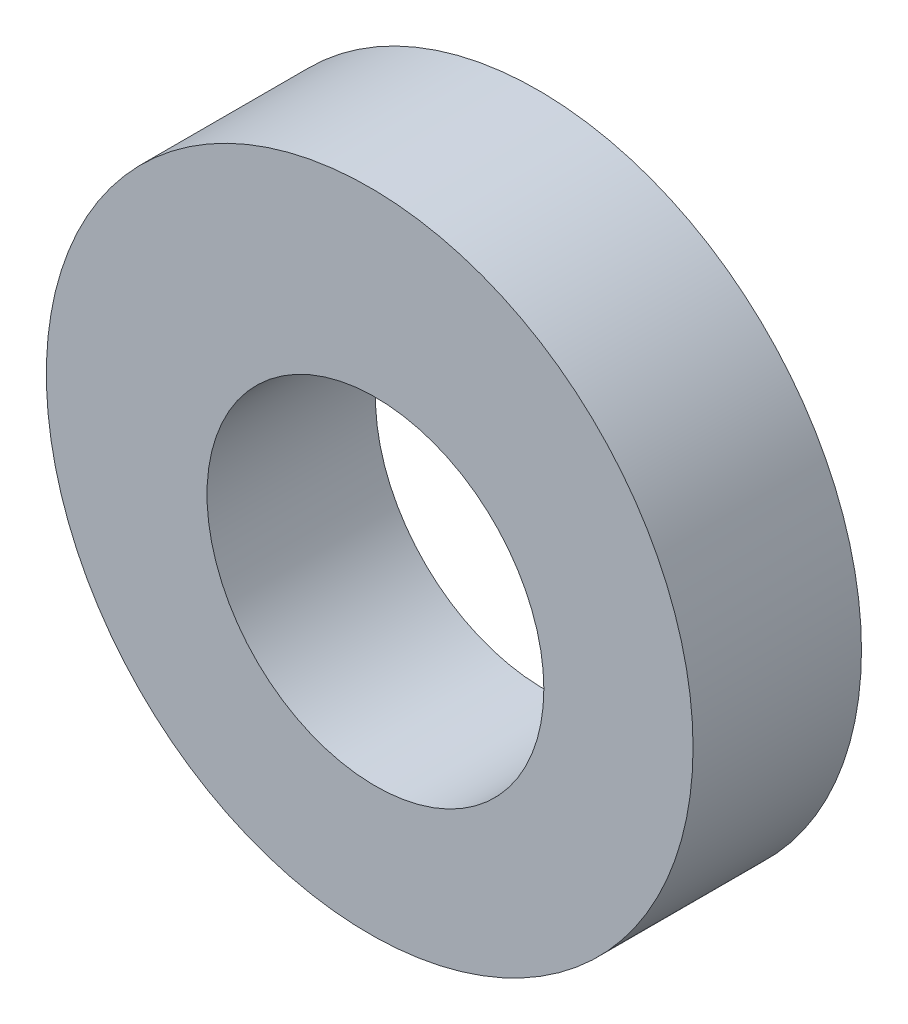
ISO-10303-21;
HEADER;
FILE_DESCRIPTION(('STEP AP214'),'2;1');
FILE_NAME('part.step','',(''),(''),'','','');
FILE_SCHEMA(('AUTOMOTIVE_DESIGN { 1 0 10303 214 1 1 1 1 }'));
ENDSEC;
DATA;
#1=APPLICATION_CONTEXT('core data for automotive mechanical design processes');
#2=APPLICATION_PROTOCOL_DEFINITION('international standard','automotive_design',2000,#1);
#3=PRODUCT_CONTEXT('',#1,'mechanical');
#4=PRODUCT('Part','Part','',(#3));
#5=PRODUCT_RELATED_PRODUCT_CATEGORY('part','',(#4));
#6=PRODUCT_DEFINITION_FORMATION('','',#4);
#7=PRODUCT_DEFINITION_CONTEXT('part definition',#1,'design');
#8=PRODUCT_DEFINITION('design','',#6,#7);
#9=PRODUCT_DEFINITION_SHAPE('','',#8);
#10=(LENGTH_UNIT() NAMED_UNIT(*) SI_UNIT(.MILLI.,.METRE.));
#11=(NAMED_UNIT(*) PLANE_ANGLE_UNIT() SI_UNIT($,.RADIAN.));
#12=(NAMED_UNIT(*) SI_UNIT($,.STERADIAN.) SOLID_ANGLE_UNIT());
#13=UNCERTAINTY_MEASURE_WITH_UNIT(LENGTH_MEASURE(1.E-05),#10,'distance_accuracy_value','');
#14=(GEOMETRIC_REPRESENTATION_CONTEXT(3) GLOBAL_UNCERTAINTY_ASSIGNED_CONTEXT((#13)) GLOBAL_UNIT_ASSIGNED_CONTEXT((#10,
#11,#12)) REPRESENTATION_CONTEXT('',''));
#15=CARTESIAN_POINT('',(0.,0.,0.));
#16=DIRECTION('',(0.,0.,1.));
#17=DIRECTION('',(1.,0.,0.));
#18=AXIS2_PLACEMENT_3D('',#15,#16,#17);
#19=CARTESIAN_POINT('',(0.,0.,5.));
#20=DIRECTION('',(0.,0.,-1.));
#21=DIRECTION('',(-1.,0.,0.));
#22=AXIS2_PLACEMENT_3D('',#19,#20,#21);
#23=CYLINDRICAL_SURFACE('',#22,9.6);
#24=CARTESIAN_POINT('',(0.,0.,5.));
#25=DIRECTION('',(0.,0.,1.));
#26=DIRECTION('',(1.,0.,0.));
#27=AXIS2_PLACEMENT_3D('',#24,#25,#26);
#28=CIRCLE('',#27,9.6);
#29=CARTESIAN_POINT('',(9.6,0.,5.));
#30=VERTEX_POINT('',#29);
#31=EDGE_CURVE('E10',#30,#30,#28,.T.);
#32=ORIENTED_EDGE('',*,*,#31,.F.);
#33=EDGE_LOOP('',(#32));
#34=FACE_BOUND('',#33,.T.);
#35=CARTESIAN_POINT('',(0.,0.,0.));
#36=DIRECTION('',(0.,0.,1.));
#37=DIRECTION('',(1.,0.,0.));
#38=AXIS2_PLACEMENT_3D('',#35,#36,#37);
#39=CIRCLE('',#38,9.6);
#40=CARTESIAN_POINT('',(9.6,0.,0.));
#41=VERTEX_POINT('',#40);
#42=EDGE_CURVE('E44',#41,#41,#39,.T.);
#43=ORIENTED_EDGE('',*,*,#42,.T.);
#44=EDGE_LOOP('',(#43));
#45=FACE_BOUND('',#44,.T.);
#46=ADVANCED_FACE('F41',(#34,#45),#23,.T.);
#47=CARTESIAN_POINT('',(0.,0.,5.));
#48=DIRECTION('',(0.,0.,1.));
#49=DIRECTION('',(1.,0.,0.));
#50=AXIS2_PLACEMENT_3D('',#47,#48,#49);
#51=PLANE('',#50);
#52=CARTESIAN_POINT('',(0.17,-0.711625570443152,5.));
#53=DIRECTION('',(0.,0.,1.));
#54=DIRECTION('',(1.,0.,0.));
#55=AXIS2_PLACEMENT_3D('',#52,#53,#54);
#56=CIRCLE('',#55,5.);
#57=CARTESIAN_POINT('',(5.17,-0.711625570443152,5.));
#58=VERTEX_POINT('',#57);
#59=EDGE_CURVE('E55',#58,#58,#56,.T.);
#60=ORIENTED_EDGE('',*,*,#59,.F.);
#61=EDGE_LOOP('',(#60));
#62=FACE_BOUND('',#61,.T.);
#63=ORIENTED_EDGE('',*,*,#31,.T.);
#64=EDGE_LOOP('',(#63));
#65=FACE_BOUND('',#64,.T.);
#66=ADVANCED_FACE('F72',(#62,#65),#51,.T.);
#67=CARTESIAN_POINT('',(0.,0.,0.));
#68=DIRECTION('',(0.,0.,1.));
#69=DIRECTION('',(1.,0.,0.));
#70=AXIS2_PLACEMENT_3D('',#67,#68,#69);
#71=PLANE('',#70);
#72=CARTESIAN_POINT('',(0.17,-0.711625570443152,0.));
#73=DIRECTION('',(0.,0.,1.));
#74=DIRECTION('',(1.,0.,0.));
#75=AXIS2_PLACEMENT_3D('',#72,#73,#74);
#76=CIRCLE('',#75,5.);
#77=CARTESIAN_POINT('',(5.17,-0.711625570443152,0.));
#78=VERTEX_POINT('',#77);
#79=EDGE_CURVE('E53',#78,#78,#76,.T.);
#80=ORIENTED_EDGE('',*,*,#79,.T.);
#81=EDGE_LOOP('',(#80));
#82=FACE_BOUND('',#81,.T.);
#83=ORIENTED_EDGE('',*,*,#42,.F.);
#84=EDGE_LOOP('',(#83));
#85=FACE_BOUND('',#84,.T.);
#86=ADVANCED_FACE('F63',(#82,#85),#71,.F.);
#87=CARTESIAN_POINT('',(0.17,-0.711625570443152,0.));
#88=DIRECTION('',(0.,0.,1.));
#89=DIRECTION('',(1.,0.,0.));
#90=AXIS2_PLACEMENT_3D('',#87,#88,#89);
#91=CYLINDRICAL_SURFACE('',#90,5.);
#92=ORIENTED_EDGE('',*,*,#79,.F.);
#93=EDGE_LOOP('',(#92));
#94=FACE_BOUND('',#93,.T.);
#95=ORIENTED_EDGE('',*,*,#59,.T.);
#96=EDGE_LOOP('',(#95));
#97=FACE_BOUND('',#96,.T.);
#98=ADVANCED_FACE('F66',(#94,#97),#91,.F.);
#99=CLOSED_SHELL('',(#46,#66,#86,#98));
#100=MANIFOLD_SOLID_BREP('B2',#99);
#101=ADVANCED_BREP_SHAPE_REPRESENTATION('',(#18,#100),#14);
#102=SHAPE_DEFINITION_REPRESENTATION(#9,#101);
ENDSEC;
END-ISO-10303-21;
